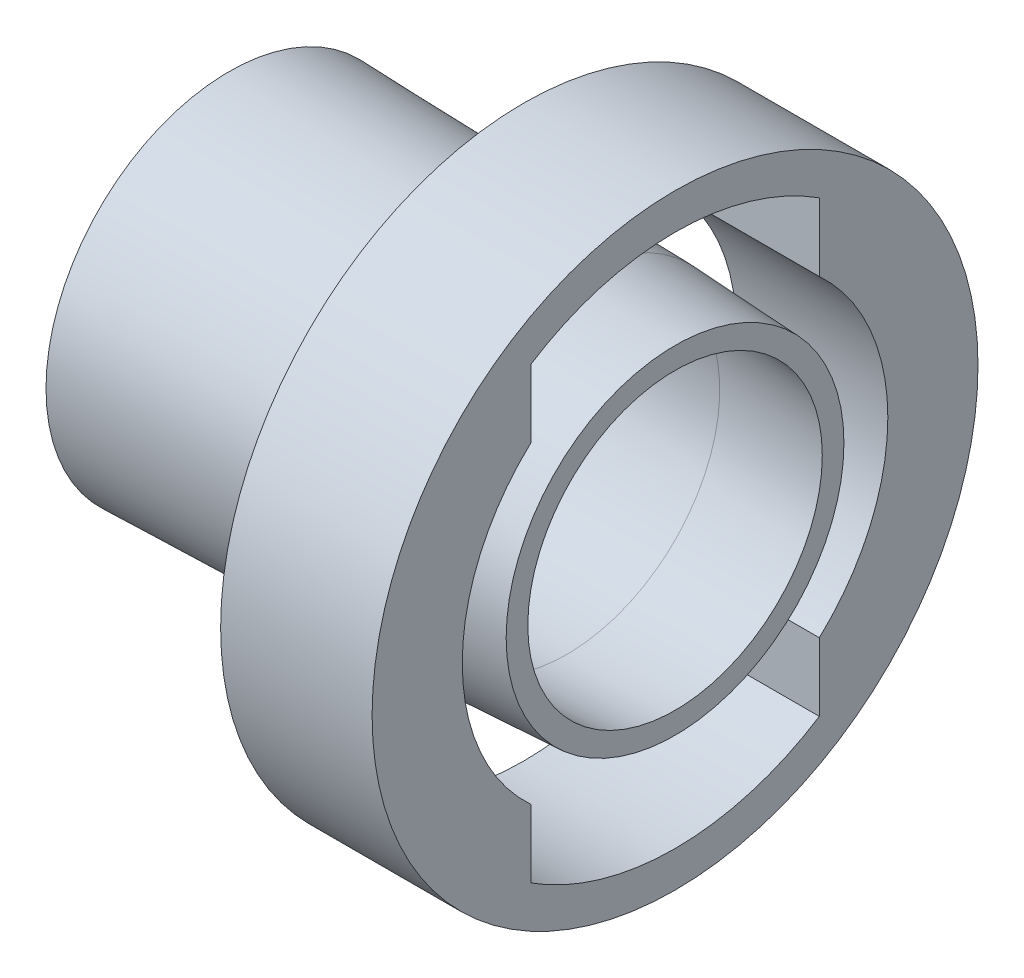
ISO-10303-21;
HEADER;
FILE_DESCRIPTION(('STEP AP214'),'2;1');
FILE_NAME('part.step','',(''),(''),'','','');
FILE_SCHEMA(('AUTOMOTIVE_DESIGN { 1 0 10303 214 1 1 1 1 }'));
ENDSEC;
DATA;
#1=APPLICATION_CONTEXT('core data for automotive mechanical design processes');
#2=APPLICATION_PROTOCOL_DEFINITION('international standard','automotive_design',2000,#1);
#3=PRODUCT_CONTEXT('',#1,'mechanical');
#4=PRODUCT('Part','Part','',(#3));
#5=PRODUCT_RELATED_PRODUCT_CATEGORY('part','',(#4));
#6=PRODUCT_DEFINITION_FORMATION('','',#4);
#7=PRODUCT_DEFINITION_CONTEXT('part definition',#1,'design');
#8=PRODUCT_DEFINITION('design','',#6,#7);
#9=PRODUCT_DEFINITION_SHAPE('','',#8);
#10=(LENGTH_UNIT() NAMED_UNIT(*) SI_UNIT(.MILLI.,.METRE.));
#11=(NAMED_UNIT(*) PLANE_ANGLE_UNIT() SI_UNIT($,.RADIAN.));
#12=(NAMED_UNIT(*) SI_UNIT($,.STERADIAN.) SOLID_ANGLE_UNIT());
#13=UNCERTAINTY_MEASURE_WITH_UNIT(LENGTH_MEASURE(1.E-05),#10,'distance_accuracy_value','');
#14=(GEOMETRIC_REPRESENTATION_CONTEXT(3) GLOBAL_UNCERTAINTY_ASSIGNED_CONTEXT((#13)) GLOBAL_UNIT_ASSIGNED_CONTEXT((#10,
#11,#12)) REPRESENTATION_CONTEXT('',''));
#15=CARTESIAN_POINT('',(0.,0.,0.));
#16=DIRECTION('',(0.,0.,1.));
#17=DIRECTION('',(1.,0.,0.));
#18=AXIS2_PLACEMENT_3D('',#15,#16,#17);
#19=CARTESIAN_POINT('',(-30.9187470712354,11.185,0.));
#20=DIRECTION('',(1.,0.,0.));
#21=DIRECTION('',(0.,0.,-1.));
#22=AXIS2_PLACEMENT_3D('',#19,#20,#21);
#23=PLANE('',#22);
#24=CARTESIAN_POINT('',(-30.9187470712354,0.,0.));
#25=DIRECTION('',(-1.,0.,0.));
#26=DIRECTION('',(0.,0.,1.));
#27=AXIS2_PLACEMENT_3D('',#24,#25,#26);
#28=CIRCLE('',#27,11.185);
#29=CARTESIAN_POINT('',(-30.9187470712354,0.,11.185));
#30=VERTEX_POINT('',#29);
#31=EDGE_CURVE('E151',#30,#30,#28,.T.);
#32=ORIENTED_EDGE('',*,*,#31,.F.);
#33=EDGE_LOOP('',(#32));
#34=FACE_BOUND('',#33,.T.);
#35=CARTESIAN_POINT('',(-30.9187470712354,0.,0.));
#36=DIRECTION('',(-1.,0.,0.));
#37=DIRECTION('',(0.,0.,1.));
#38=AXIS2_PLACEMENT_3D('',#35,#36,#37);
#39=CIRCLE('',#38,12.6854686767807);
#40=CARTESIAN_POINT('',(-30.9187470712354,0.,12.6854686767807));
#41=VERTEX_POINT('',#40);
#42=EDGE_CURVE('E13',#41,#41,#39,.T.);
#43=ORIENTED_EDGE('',*,*,#42,.T.);
#44=EDGE_LOOP('',(#43));
#45=FACE_BOUND('',#44,.T.);
#46=ADVANCED_FACE('F129',(#34,#45),#23,.F.);
#47=CARTESIAN_POINT('',(-7.5,0.,0.));
#48=DIRECTION('',(-1.,0.,0.));
#49=DIRECTION('',(0.,0.,1.));
#50=AXIS2_PLACEMENT_3D('',#47,#48,#49);
#51=CONICAL_SURFACE('',#50,12.1,0.024994793618913);
#52=ORIENTED_EDGE('',*,*,#42,.F.);
#53=EDGE_LOOP('',(#52));
#54=FACE_BOUND('',#53,.T.);
#55=CARTESIAN_POINT('',(-7.5,0.,0.));
#56=DIRECTION('',(-1.,0.,0.));
#57=DIRECTION('',(0.,0.,1.));
#58=AXIS2_PLACEMENT_3D('',#55,#56,#57);
#59=CIRCLE('',#58,12.1);
#60=CARTESIAN_POINT('',(-7.5,0.,12.1));
#61=VERTEX_POINT('',#60);
#62=EDGE_CURVE('E135',#61,#61,#59,.T.);
#63=ORIENTED_EDGE('',*,*,#62,.T.);
#64=EDGE_LOOP('',(#63));
#65=FACE_BOUND('',#64,.T.);
#66=ADVANCED_FACE('F158',(#54,#65),#51,.T.);
#67=CARTESIAN_POINT('',(0.,0.,0.));
#68=DIRECTION('',(-1.,0.,0.));
#69=DIRECTION('',(0.,0.,1.));
#70=AXIS2_PLACEMENT_3D('',#67,#68,#69);
#71=CONICAL_SURFACE('',#70,11.7069416553772,0.0523598775598228);
#72=ORIENTED_EDGE('',*,*,#62,.F.);
#73=EDGE_LOOP('',(#72));
#74=FACE_BOUND('',#73,.T.);
#75=CARTESIAN_POINT('',(0.,0.,0.));
#76=DIRECTION('',(-1.,0.,0.));
#77=DIRECTION('',(0.,0.,1.));
#78=AXIS2_PLACEMENT_3D('',#75,#76,#77);
#79=CIRCLE('',#78,11.7069416553772);
#80=CARTESIAN_POINT('',(0.,0.,11.7069416553772));
#81=VERTEX_POINT('',#80);
#82=EDGE_CURVE('E139',#81,#81,#79,.T.);
#83=ORIENTED_EDGE('',*,*,#82,.T.);
#84=EDGE_LOOP('',(#83));
#85=FACE_BOUND('',#84,.T.);
#86=ADVANCED_FACE('F162',(#74,#85),#71,.T.);
#87=CARTESIAN_POINT('',(0.,10.2064729785965,0.));
#88=DIRECTION('',(-1.,0.,0.));
#89=DIRECTION('',(0.,0.,1.));
#90=AXIS2_PLACEMENT_3D('',#87,#88,#89);
#91=PLANE('',#90);
#92=ORIENTED_EDGE('',*,*,#82,.F.);
#93=EDGE_LOOP('',(#92));
#94=FACE_BOUND('',#93,.T.);
#95=CARTESIAN_POINT('',(0.,0.,0.));
#96=DIRECTION('',(-1.,0.,0.));
#97=DIRECTION('',(0.,0.,1.));
#98=AXIS2_PLACEMENT_3D('',#95,#96,#97);
#99=CIRCLE('',#98,10.2064729785965);
#100=CARTESIAN_POINT('',(0.,0.,10.2064729785965));
#101=VERTEX_POINT('',#100);
#102=EDGE_CURVE('E143',#101,#101,#99,.T.);
#103=ORIENTED_EDGE('',*,*,#102,.T.);
#104=EDGE_LOOP('',(#103));
#105=FACE_BOUND('',#104,.T.);
#106=ADVANCED_FACE('F167',(#94,#105),#91,.F.);
#107=CARTESIAN_POINT('',(-7.5,0.,0.));
#108=DIRECTION('',(-1.,0.,0.));
#109=DIRECTION('',(0.,0.,1.));
#110=AXIS2_PLACEMENT_3D('',#107,#108,#109);
#111=CONICAL_SURFACE('',#110,10.5995313232193,0.0523598775598223);
#112=ORIENTED_EDGE('',*,*,#102,.F.);
#113=EDGE_LOOP('',(#112));
#114=FACE_BOUND('',#113,.T.);
#115=CARTESIAN_POINT('',(-7.5,0.,0.));
#116=DIRECTION('',(-1.,0.,0.));
#117=DIRECTION('',(0.,0.,1.));
#118=AXIS2_PLACEMENT_3D('',#115,#116,#117);
#119=CIRCLE('',#118,10.5995313232193);
#120=CARTESIAN_POINT('',(-7.5,0.,10.5995313232193));
#121=VERTEX_POINT('',#120);
#122=EDGE_CURVE('E148',#121,#121,#119,.T.);
#123=ORIENTED_EDGE('',*,*,#122,.T.);
#124=EDGE_LOOP('',(#123));
#125=FACE_BOUND('',#124,.T.);
#126=ADVANCED_FACE('F173',(#114,#125),#111,.F.);
#127=CARTESIAN_POINT('',(-30.9187470712354,0.,0.));
#128=DIRECTION('',(-1.,0.,0.));
#129=DIRECTION('',(0.,0.,1.));
#130=AXIS2_PLACEMENT_3D('',#127,#128,#129);
#131=CONICAL_SURFACE('',#130,11.185,0.0249947936189131);
#132=ORIENTED_EDGE('',*,*,#122,.F.);
#133=EDGE_LOOP('',(#132));
#134=FACE_BOUND('',#133,.T.);
#135=ORIENTED_EDGE('',*,*,#31,.T.);
#136=EDGE_LOOP('',(#135));
#137=FACE_BOUND('',#136,.T.);
#138=ADVANCED_FACE('F155',(#134,#137),#131,.F.);
#139=CLOSED_SHELL('',(#46,#66,#86,#106,#126,#138));
#140=MANIFOLD_SOLID_BREP('B2',#139);
#141=CARTESIAN_POINT('',(0.,0.,0.));
#142=DIRECTION('',(-1.,0.,0.));
#143=DIRECTION('',(0.,0.,1.));
#144=AXIS2_PLACEMENT_3D('',#141,#142,#143);
#145=CYLINDRICAL_SURFACE('',#144,14.75);
#146=DIRECTION('',(-1.,0.,0.));
#147=VECTOR('',#146,1.);
#148=CARTESIAN_POINT('',(0.,-10.,10.8426242211007));
#149=LINE('',#148,#147);
#150=CARTESIAN_POINT('',(-3.5,-10.,10.8426242211007));
#151=VERTEX_POINT('',#150);
#152=CARTESIAN_POINT('',(-10.5,-10.,10.8426242211007));
#153=VERTEX_POINT('',#152);
#154=EDGE_CURVE('E414',#151,#153,#149,.T.);
#155=ORIENTED_EDGE('',*,*,#154,.F.);
#156=CARTESIAN_POINT('',(-3.5,-10.,10.8426242211007));
#157=CARTESIAN_POINT('',(-3.49068289825081,-9.8477461184323,10.9830490255692));
#158=CARTESIAN_POINT('',(-3.48131075614257,-9.6925330119664,11.1202618603278));
#159=CARTESIAN_POINT('',(-3.46279008685107,-9.37644426882183,11.3880500590856));
#160=CARTESIAN_POINT('',(-3.45364158134082,-9.21556808698197,11.5186247810872));
#161=CARTESIAN_POINT('',(-3.43590345498772,-8.88843208529065,11.7729010977128));
#162=CARTESIAN_POINT('',(-3.42731385645937,-8.72217205088384,11.8966024178857));
#163=CARTESIAN_POINT('',(-3.41104249384766,-8.38455850021666,12.136911055014));
#164=CARTESIAN_POINT('',(-3.40336072831973,-8.21320499206174,12.2535183832575));
#165=CARTESIAN_POINT('',(-3.38928491143141,-7.8663626586734,12.4790007927033));
#166=CARTESIAN_POINT('',(-3.38288605798964,-7.69089210914528,12.5879036822798));
#167=CARTESIAN_POINT('',(-3.37169056811283,-7.33550167693567,12.7982636098841));
#168=CARTESIAN_POINT('',(-3.36689386758477,-7.15558197254891,12.8997209456393));
#169=CARTESIAN_POINT('',(-3.35925139711313,-6.79160724586054,13.0950076143184));
#170=CARTESIAN_POINT('',(-3.35640563031815,-6.60755221688548,13.1888369349313));
#171=CARTESIAN_POINT('',(-3.35300998458459,-6.23562805862445,13.3686991030945));
#172=CARTESIAN_POINT('',(-3.35246031828272,-6.04775857770946,13.4547312278423));
#173=CARTESIAN_POINT('',(-3.35399271306223,-5.66957066777972,13.6183956052958));
#174=CARTESIAN_POINT('',(-3.35606103103027,-5.4792701758139,13.6960694195787));
#175=CARTESIAN_POINT('',(-3.36313375256999,-5.09563254197148,13.8433828718047));
#176=CARTESIAN_POINT('',(-3.36813821251843,-4.90229534185652,13.9130223554502));
#177=CARTESIAN_POINT('',(-3.38140066455927,-4.51300606778088,14.0441251987416));
#178=CARTESIAN_POINT('',(-3.38965820562703,-4.31705435994666,14.1055896902329));
#179=CARTESIAN_POINT('',(-3.40974253713639,-3.92297120097847,14.2202285460817));
#180=CARTESIAN_POINT('',(-3.42156850615943,-3.72484026158584,14.2734048140428));
#181=CARTESIAN_POINT('',(-3.44909157620783,-3.3264617160412,14.371475016524));
#182=CARTESIAN_POINT('',(-3.46479476862795,-3.12621125840935,14.416355722226));
#183=CARTESIAN_POINT('',(-3.4914239931403,-2.82483212453093,14.4773386711365));
#184=CARTESIAN_POINT('',(-3.50081360223244,-2.72419781451132,14.4966111405956));
#185=CARTESIAN_POINT('',(-3.52056913752248,-2.52264225536133,14.5330404122778));
#186=CARTESIAN_POINT('',(-3.53093506737886,-2.42172100515709,14.5501972065725));
#187=CARTESIAN_POINT('',(-3.56317847114939,-2.11853430051751,14.5985001477906));
#188=CARTESIAN_POINT('',(-3.58619875961502,-1.91587640617345,14.6264726823367));
#189=CARTESIAN_POINT('',(-3.63402577487051,-1.50977032851817,14.6739529877871));
#190=CARTESIAN_POINT('',(-3.65883269078366,-1.30632206370521,14.6934598610195));
#191=CARTESIAN_POINT('',(-3.70790370990943,-0.908007467752809,14.7233181561805));
#192=CARTESIAN_POINT('',(-3.73214220621249,-0.713165778755622,14.7340411920772));
#193=CARTESIAN_POINT('',(-3.7801133763745,-0.323186388277613,14.7477493605214));
#194=CARTESIAN_POINT('',(-3.80384614929502,-0.128048752939792,14.7507360225554));
#195=CARTESIAN_POINT('',(-3.84974660401898,0.26233807443667,14.7489583212846));
#196=CARTESIAN_POINT('',(-3.87191460438859,0.457587235563059,14.744195540436));
#197=CARTESIAN_POINT('',(-3.91354830173493,0.848021805362069,14.7268985185325));
#198=CARTESIAN_POINT('',(-3.9330141758796,1.04320721737651,14.7143647872835));
#199=CARTESIAN_POINT('',(-3.96794187873431,1.43267855249339,14.6815531272648));
#200=CARTESIAN_POINT('',(-3.98341599948806,1.62696538289636,14.6612994600578));
#201=CARTESIAN_POINT('',(-4.00908821693341,2.01495051242341,14.6130314223098));
#202=CARTESIAN_POINT('',(-4.01928572095076,2.20864874300743,14.5850161805243));
#203=CARTESIAN_POINT('',(-4.03453432644098,2.59497859036452,14.5212574463459));
#204=CARTESIAN_POINT('',(-4.03958521958272,2.78761016364619,14.4855136411774));
#205=CARTESIAN_POINT('',(-4.04484618312528,3.1713414566988,14.4063692255715));
#206=CARTESIAN_POINT('',(-4.04505654734346,3.36244126874287,14.3629690800308));
#207=CARTESIAN_POINT('',(-4.04030693120079,3.80014403968906,14.2543484854418));
#208=CARTESIAN_POINT('',(-4.03376651310837,4.04608205763247,14.1864964121077));
#209=CARTESIAN_POINT('',(-4.01367589955739,4.53385126820216,14.0382222601152));
#210=CARTESIAN_POINT('',(-4.00012520148263,4.77568216507588,13.9577992804489));
#211=CARTESIAN_POINT('',(-3.96673208834328,5.25447696901661,13.7846935373355));
#212=CARTESIAN_POINT('',(-3.94688946102543,5.49144071160682,13.6920103603618));
#213=CARTESIAN_POINT('',(-3.90155390071219,5.96080348827687,13.4943116413055));
#214=CARTESIAN_POINT('',(-3.87603729022978,6.19317881566554,13.3892453142282));
#215=CARTESIAN_POINT('',(-3.82016489629219,6.65168404722985,13.16747696156));
#216=CARTESIAN_POINT('',(-3.78980945900371,6.87781439681069,13.0507757685438));
#217=CARTESIAN_POINT('',(-3.72502918064806,7.32327547825964,12.8061197597428));
#218=CARTESIAN_POINT('',(-3.69060468270425,7.54260678149104,12.6781658930719));
#219=CARTESIAN_POINT('',(-3.62262200384524,7.94908703490707,12.4267793947215));
#220=CARTESIAN_POINT('',(-3.58942225734082,8.13702903450714,12.3045288916445));
#221=CARTESIAN_POINT('',(-3.52097836679001,8.50688398153636,12.0517877328957));
#222=CARTESIAN_POINT('',(-3.48573437310055,8.68879737083472,11.9212976831905));
#223=CARTESIAN_POINT('',(-3.41372941216736,9.04630858841445,11.6523320036907));
#224=CARTESIAN_POINT('',(-3.37696844277384,9.221906407745,11.5138563625792));
#225=CARTESIAN_POINT('',(-3.30270700292207,9.56530827383105,11.2301663004948));
#226=CARTESIAN_POINT('',(-3.26521342442737,9.7331579059977,11.0850052418789));
#227=CARTESIAN_POINT('',(-3.18973828898552,10.0620776773763,10.78732083924));
#228=CARTESIAN_POINT('',(-3.15175673808728,10.2231479005201,10.6347975864143));
#229=CARTESIAN_POINT('',(-3.07577549236125,10.5382375216478,10.3226563465279));
#230=CARTESIAN_POINT('',(-3.03777579867568,10.6922573161895,10.1630387594923));
#231=CARTESIAN_POINT('',(-3.,10.8426242211014,10.0000000000002));
#232=B_SPLINE_CURVE_WITH_KNOTS('',3,(#156,#157,#158,#159,#160,#161,#162,#163,#164,#165,#166,
#167,#168,#169,#170,#171,#172,#173,#174,#175,#176,#177,#178,#179,#180,#181,#182,#183,#184,#185,
#186,#187,#188,#189,#190,#191,#192,#193,#194,#195,#196,#197,#198,#199,#200,#201,#202,#203,#204,
#205,#206,#207,#208,#209,#210,#211,#212,#213,#214,#215,#216,#217,#218,#219,#220,#221,#222,#223,
#224,#225,#226,#227,#228,#229,#230,#231),.UNSPECIFIED.,.F.,.F.,(4,2,2,2,2,2,2,2,2,2,2,2,2,2,2,2,
2,2,2,2,2,2,2,2,2,2,2,2,2,2,2,2,2,2,2,2,2,4),(0.,0.621954927275421,1.24396989224003,
1.86600967610192,2.48804847014078,3.10771355154563,3.72735384070553,4.34699512989301,
4.96669380139528,5.58315281424756,6.19962366409531,6.81600907317592,7.43225270422974,
8.0494707281461,8.35812465148851,8.66677973146638,9.28418357925544,9.9016528786028,
10.491409460435,11.0810494380803,11.6705690248248,12.2600499407785,12.8476933599291,
13.435402769387,14.0231359679552,14.6108334913566,15.3759943229841,16.1412100219707,
16.9064515376522,17.6749484143476,18.443390337901,19.2117675087893,19.8914771184436,
20.5711367978474,21.2507974404679,21.9257470666609,22.6006883342324,23.2755915923457),.UNSPECIFIED.);
#233=CARTESIAN_POINT('',(-3.,10.8426242211007,10.));
#234=VERTEX_POINT('',#233);
#235=EDGE_CURVE('E327',#151,#234,#232,.T.);
#236=ORIENTED_EDGE('',*,*,#235,.T.);
#237=DIRECTION('',(1.,0.,0.));
#238=VECTOR('',#237,1.);
#239=CARTESIAN_POINT('',(-10.5,10.8426242211007,10.));
#240=LINE('',#239,#238);
#241=CARTESIAN_POINT('',(0.,10.8426242211007,10.));
#242=VERTEX_POINT('',#241);
#243=EDGE_CURVE('E301',#234,#242,#240,.T.);
#244=ORIENTED_EDGE('',*,*,#243,.T.);
#245=CARTESIAN_POINT('',(0.,0.,0.));
#246=DIRECTION('',(-1.,0.,0.));
#247=DIRECTION('',(0.,0.,1.));
#248=AXIS2_PLACEMENT_3D('',#245,#246,#247);
#249=CIRCLE('',#248,14.75);
#250=CARTESIAN_POINT('',(0.,-10.8426242211007,10.));
#251=VERTEX_POINT('',#250);
#252=EDGE_CURVE('E293',#251,#242,#249,.T.);
#253=ORIENTED_EDGE('',*,*,#252,.F.);
#254=DIRECTION('',(1.,0.,0.));
#255=VECTOR('',#254,1.);
#256=CARTESIAN_POINT('',(-10.5,-10.8426242211007,10.));
#257=LINE('',#256,#255);
#258=CARTESIAN_POINT('',(-10.5,-10.8426242211007,10.));
#259=VERTEX_POINT('',#258);
#260=EDGE_CURVE('E248',#259,#251,#257,.T.);
#261=ORIENTED_EDGE('',*,*,#260,.F.);
#262=CARTESIAN_POINT('',(-10.5,0.,0.));
#263=DIRECTION('',(-1.,0.,0.));
#264=DIRECTION('',(0.,0.,1.));
#265=AXIS2_PLACEMENT_3D('',#262,#263,#264);
#266=CIRCLE('',#265,14.75);
#267=EDGE_CURVE('E292',#259,#153,#266,.T.);
#268=ORIENTED_EDGE('',*,*,#267,.T.);
#269=EDGE_LOOP('',(#155,#236,#244,#253,#261,#268));
#270=FACE_BOUND('',#269,.T.);
#271=ADVANCED_FACE('F221',(#270),#145,.F.);
#272=CARTESIAN_POINT('',(-10.5,0.,0.));
#273=DIRECTION('',(1.,0.,0.));
#274=DIRECTION('',(0.,0.,-1.));
#275=AXIS2_PLACEMENT_3D('',#272,#273,#274);
#276=PLANE('',#275);
#277=CARTESIAN_POINT('',(-10.5,0.,0.));
#278=DIRECTION('',(-1.,0.,0.));
#279=DIRECTION('',(0.,0.,1.));
#280=AXIS2_PLACEMENT_3D('',#277,#278,#279);
#281=CIRCLE('',#280,21.);
#282=CARTESIAN_POINT('',(-10.5,0.,21.));
#283=VERTEX_POINT('',#282);
#284=EDGE_CURVE('E320',#283,#283,#281,.T.);
#285=ORIENTED_EDGE('',*,*,#284,.T.);
#286=EDGE_LOOP('',(#285));
#287=FACE_BOUND('',#286,.T.);
#288=DIRECTION('',(0.,0.,-1.));
#289=VECTOR('',#288,1.);
#290=CARTESIAN_POINT('',(-10.5,-10.,9.84262422110071));
#291=LINE('',#290,#289);
#292=CARTESIAN_POINT('',(-10.5,-10.,15.5643824162734));
#293=VERTEX_POINT('',#292);
#294=EDGE_CURVE('E437',#293,#153,#291,.T.);
#295=ORIENTED_EDGE('',*,*,#294,.T.);
#296=ORIENTED_EDGE('',*,*,#267,.F.);
#297=DIRECTION('',(0.,1.,0.));
#298=VECTOR('',#297,1.);
#299=CARTESIAN_POINT('',(-10.5,0.,10.));
#300=LINE('',#299,#298);
#301=CARTESIAN_POINT('',(-10.5,-15.5643824162734,10.));
#302=VERTEX_POINT('',#301);
#303=EDGE_CURVE('E462',#302,#259,#300,.T.);
#304=ORIENTED_EDGE('',*,*,#303,.F.);
#305=CARTESIAN_POINT('',(-10.5,0.,0.));
#306=DIRECTION('',(1.,0.,0.));
#307=DIRECTION('',(0.,0.,-1.));
#308=AXIS2_PLACEMENT_3D('',#305,#306,#307);
#309=CIRCLE('',#308,18.5);
#310=CARTESIAN_POINT('',(-10.5,-15.5643824162734,-10.));
#311=VERTEX_POINT('',#310);
#312=EDGE_CURVE('E460',#311,#302,#309,.F.);
#313=ORIENTED_EDGE('',*,*,#312,.F.);
#314=DIRECTION('',(0.,1.,0.));
#315=VECTOR('',#314,1.);
#316=CARTESIAN_POINT('',(-10.5,0.,-10.));
#317=LINE('',#316,#315);
#318=CARTESIAN_POINT('',(-10.5,-10.8426242211007,-10.));
#319=VERTEX_POINT('',#318);
#320=EDGE_CURVE('E457',#311,#319,#317,.T.);
#321=ORIENTED_EDGE('',*,*,#320,.T.);
#322=CARTESIAN_POINT('',(-10.5,10.8426242211007,-10.));
#323=VERTEX_POINT('',#322);
#324=EDGE_CURVE('E283',#323,#319,#266,.T.);
#325=ORIENTED_EDGE('',*,*,#324,.F.);
#326=DIRECTION('',(0.,-1.,0.));
#327=VECTOR('',#326,1.);
#328=CARTESIAN_POINT('',(-10.5,0.,-10.));
#329=LINE('',#328,#327);
#330=CARTESIAN_POINT('',(-10.5,15.5643824162734,-10.));
#331=VERTEX_POINT('',#330);
#332=EDGE_CURVE('E464',#331,#323,#329,.T.);
#333=ORIENTED_EDGE('',*,*,#332,.F.);
#334=CARTESIAN_POINT('',(-10.5,0.,0.));
#335=DIRECTION('',(1.,0.,0.));
#336=DIRECTION('',(0.,0.,-1.));
#337=AXIS2_PLACEMENT_3D('',#334,#335,#336);
#338=CIRCLE('',#337,18.5);
#339=CARTESIAN_POINT('',(-10.5,15.5643824162734,10.));
#340=VERTEX_POINT('',#339);
#341=EDGE_CURVE('E329',#340,#331,#338,.F.);
#342=ORIENTED_EDGE('',*,*,#341,.F.);
#343=CARTESIAN_POINT('',(-10.5,15.5643824162734,10.));
#344=CARTESIAN_POINT('',(-10.5,13.5107102991569,13.1964138188438));
#345=CARTESIAN_POINT('',(-10.5,10.0959682442306,15.9941540069139));
#346=CARTESIAN_POINT('',(-10.5,5.63706378043799,17.6498691461082));
#347=CARTESIAN_POINT('',(-10.5,3.30744822542792,18.2612567423603));
#348=CARTESIAN_POINT('',(-10.5,1.32645603147929,18.4928644130839));
#349=CARTESIAN_POINT('',(-10.5,-0.476464522258134,18.5013670453642));
#350=CARTESIAN_POINT('',(-10.5,-4.03963049920302,18.3392281470737));
#351=CARTESIAN_POINT('',(-10.5,-7.36265944829708,17.2588541152889));
#352=CARTESIAN_POINT('',(-10.5,-10.,15.5643824162734));
#353=B_SPLINE_CURVE_WITH_KNOTS('',3,(#343,#344,#345,#346,#347,#348,#349,#350,#351,#352),
.UNSPECIFIED.,.F.,.F.,(4,1,1,1,1,1,1,4),(0.,0.375,0.444620298396432,0.5,0.625,0.643572908926656,
0.6875,1.),.UNSPECIFIED.);
#354=EDGE_CURVE('E442',#340,#293,#353,.T.);
#355=ORIENTED_EDGE('',*,*,#354,.T.);
#356=EDGE_LOOP('',(#295,#296,#304,#313,#321,#325,#333,#342,#355));
#357=FACE_BOUND('',#356,.T.);
#358=ADVANCED_FACE('F420',(#287,#357),#276,.F.);
#359=CARTESIAN_POINT('',(0.,0.,0.));
#360=DIRECTION('',(-1.,0.,0.));
#361=DIRECTION('',(0.,0.,1.));
#362=AXIS2_PLACEMENT_3D('',#359,#360,#361);
#363=CYLINDRICAL_SURFACE('',#362,21.);
#364=CARTESIAN_POINT('',(0.,0.,0.));
#365=DIRECTION('',(-1.,0.,0.));
#366=DIRECTION('',(0.,0.,1.));
#367=AXIS2_PLACEMENT_3D('',#364,#365,#366);
#368=CIRCLE('',#367,21.);
#369=CARTESIAN_POINT('',(0.,0.,21.));
#370=VERTEX_POINT('',#369);
#371=EDGE_CURVE('E284',#370,#370,#368,.T.);
#372=ORIENTED_EDGE('',*,*,#371,.T.);
#373=EDGE_LOOP('',(#372));
#374=FACE_BOUND('',#373,.T.);
#375=ORIENTED_EDGE('',*,*,#284,.F.);
#376=EDGE_LOOP('',(#375));
#377=FACE_BOUND('',#376,.T.);
#378=ADVANCED_FACE('F223',(#374,#377),#363,.T.);
#379=ORIENTED_EDGE('',*,*,#324,.T.);
#380=DIRECTION('',(1.,0.,0.));
#381=VECTOR('',#380,1.);
#382=CARTESIAN_POINT('',(-10.5,-10.8426242211007,-10.));
#383=LINE('',#382,#381);
#384=CARTESIAN_POINT('',(0.,-10.8426242211007,-10.));
#385=VERTEX_POINT('',#384);
#386=EDGE_CURVE('E269',#319,#385,#383,.T.);
#387=ORIENTED_EDGE('',*,*,#386,.T.);
#388=CARTESIAN_POINT('',(0.,0.,0.));
#389=DIRECTION('',(-1.,0.,0.));
#390=DIRECTION('',(0.,0.,1.));
#391=AXIS2_PLACEMENT_3D('',#388,#389,#390);
#392=CIRCLE('',#391,14.75);
#393=CARTESIAN_POINT('',(0.,10.8426242211007,-10.));
#394=VERTEX_POINT('',#393);
#395=EDGE_CURVE('E281',#394,#385,#392,.T.);
#396=ORIENTED_EDGE('',*,*,#395,.F.);
#397=DIRECTION('',(1.,0.,0.));
#398=VECTOR('',#397,1.);
#399=CARTESIAN_POINT('',(-10.5,10.8426242211007,-10.));
#400=LINE('',#399,#398);
#401=EDGE_CURVE('E315',#323,#394,#400,.T.);
#402=ORIENTED_EDGE('',*,*,#401,.F.);
#403=EDGE_LOOP('',(#379,#387,#396,#402));
#404=FACE_BOUND('',#403,.T.);
#405=ADVANCED_FACE('F279',(#404),#145,.F.);
#406=CARTESIAN_POINT('',(0.,0.,0.));
#407=DIRECTION('',(1.,0.,0.));
#408=DIRECTION('',(0.,0.,-1.));
#409=AXIS2_PLACEMENT_3D('',#406,#407,#408);
#410=PLANE('',#409);
#411=DIRECTION('',(0.,1.,0.));
#412=VECTOR('',#411,1.);
#413=CARTESIAN_POINT('',(0.,0.,-10.));
#414=LINE('',#413,#412);
#415=CARTESIAN_POINT('',(0.,-15.5643824162734,-10.));
#416=VERTEX_POINT('',#415);
#417=EDGE_CURVE('E127',#416,#385,#414,.T.);
#418=ORIENTED_EDGE('',*,*,#417,.F.);
#419=CARTESIAN_POINT('',(0.,0.,0.));
#420=DIRECTION('',(1.,0.,0.));
#421=DIRECTION('',(0.,0.,-1.));
#422=AXIS2_PLACEMENT_3D('',#419,#420,#421);
#423=CIRCLE('',#422,18.5);
#424=CARTESIAN_POINT('',(0.,-15.5643824162734,10.));
#425=VERTEX_POINT('',#424);
#426=EDGE_CURVE('E230',#416,#425,#423,.F.);
#427=ORIENTED_EDGE('',*,*,#426,.T.);
#428=DIRECTION('',(0.,1.,0.));
#429=VECTOR('',#428,1.);
#430=CARTESIAN_POINT('',(0.,0.,10.));
#431=LINE('',#430,#429);
#432=EDGE_CURVE('E486',#425,#251,#431,.T.);
#433=ORIENTED_EDGE('',*,*,#432,.T.);
#434=ORIENTED_EDGE('',*,*,#252,.T.);
#435=DIRECTION('',(0.,-1.,0.));
#436=VECTOR('',#435,1.);
#437=CARTESIAN_POINT('',(0.,0.,10.));
#438=LINE('',#437,#436);
#439=CARTESIAN_POINT('',(0.,15.5643824162734,10.));
#440=VERTEX_POINT('',#439);
#441=EDGE_CURVE('E483',#440,#242,#438,.T.);
#442=ORIENTED_EDGE('',*,*,#441,.F.);
#443=CARTESIAN_POINT('',(0.,0.,0.));
#444=DIRECTION('',(1.,0.,0.));
#445=DIRECTION('',(0.,0.,-1.));
#446=AXIS2_PLACEMENT_3D('',#443,#444,#445);
#447=CIRCLE('',#446,18.5);
#448=CARTESIAN_POINT('',(0.,15.5643824162734,-10.));
#449=VERTEX_POINT('',#448);
#450=EDGE_CURVE('E487',#440,#449,#447,.F.);
#451=ORIENTED_EDGE('',*,*,#450,.T.);
#452=DIRECTION('',(0.,1.,0.));
#453=VECTOR('',#452,1.);
#454=CARTESIAN_POINT('',(0.,0.,-10.));
#455=LINE('',#454,#453);
#456=EDGE_CURVE('E291',#449,#394,#455,.F.);
#457=ORIENTED_EDGE('',*,*,#456,.T.);
#458=ORIENTED_EDGE('',*,*,#395,.T.);
#459=EDGE_LOOP('',(#418,#427,#433,#434,#442,#451,#457,#458));
#460=FACE_BOUND('',#459,.T.);
#461=ORIENTED_EDGE('',*,*,#371,.F.);
#462=EDGE_LOOP('',(#461));
#463=FACE_BOUND('',#462,.T.);
#464=ADVANCED_FACE('F287',(#460,#463),#410,.T.);
#465=CARTESIAN_POINT('',(-10.5,0.,-10.));
#466=DIRECTION('',(0.,0.,1.));
#467=DIRECTION('',(0.,-1.,0.));
#468=AXIS2_PLACEMENT_3D('',#465,#466,#467);
#469=PLANE('',#468);
#470=DIRECTION('',(1.,0.,0.));
#471=VECTOR('',#470,1.);
#472=CARTESIAN_POINT('',(-10.5,15.5643824162734,-10.));
#473=LINE('',#472,#471);
#474=EDGE_CURVE('E312',#331,#449,#473,.T.);
#475=ORIENTED_EDGE('',*,*,#474,.F.);
#476=ORIENTED_EDGE('',*,*,#332,.T.);
#477=ORIENTED_EDGE('',*,*,#401,.T.);
#478=ORIENTED_EDGE('',*,*,#456,.F.);
#479=EDGE_LOOP('',(#475,#476,#477,#478));
#480=FACE_BOUND('',#479,.T.);
#481=ADVANCED_FACE('F521',(#480),#469,.T.);
#482=CARTESIAN_POINT('',(-10.5,0.,0.));
#483=DIRECTION('',(1.,0.,0.));
#484=DIRECTION('',(0.,0.,-1.));
#485=AXIS2_PLACEMENT_3D('',#482,#483,#484);
#486=CYLINDRICAL_SURFACE('',#485,18.5);
#487=CARTESIAN_POINT('',(-10.5,15.5643824162734,10.));
#488=CARTESIAN_POINT('',(-9.875,15.5643824162734,10.));
#489=CARTESIAN_POINT('',(-8.62500000000001,15.5643824162734,10.));
#490=CARTESIAN_POINT('',(-6.74999999999999,15.5643824162734,10.));
#491=CARTESIAN_POINT('',(-4.87500000000001,15.5643824162734,10.));
#492=CARTESIAN_POINT('',(-3.625,15.5643824162734,10.));
#493=CARTESIAN_POINT('',(-3.,15.5643824162734,10.));
#494=B_SPLINE_CURVE_WITH_KNOTS('',3,(#487,#488,#489,#490,#491,#492,#493),.UNSPECIFIED.,.F.,.F.,
(4,1,1,1,4),(0.72505475109584,0.79379106332188,0.86252737554792,0.93126368777396,1.),.UNSPECIFIED.);
#495=CARTESIAN_POINT('',(-3.,15.5643824162734,10.));
#496=VERTEX_POINT('',#495);
#497=EDGE_CURVE('E238',#340,#496,#494,.T.);
#498=ORIENTED_EDGE('',*,*,#497,.F.);
#499=ORIENTED_EDGE('',*,*,#341,.T.);
#500=ORIENTED_EDGE('',*,*,#474,.T.);
#501=ORIENTED_EDGE('',*,*,#450,.F.);
#502=DIRECTION('',(1.,0.,0.));
#503=VECTOR('',#502,1.);
#504=CARTESIAN_POINT('',(-10.5,15.5643824162734,10.));
#505=LINE('',#504,#503);
#506=EDGE_CURVE('E305',#496,#440,#505,.T.);
#507=ORIENTED_EDGE('',*,*,#506,.F.);
#508=EDGE_LOOP('',(#498,#499,#500,#501,#507));
#509=FACE_BOUND('',#508,.T.);
#510=ADVANCED_FACE('F494',(#509),#486,.F.);
#511=CARTESIAN_POINT('',(-10.5,0.,10.));
#512=DIRECTION('',(0.,0.,1.));
#513=DIRECTION('',(0.,-1.,0.));
#514=AXIS2_PLACEMENT_3D('',#511,#512,#513);
#515=PLANE('',#514);
#516=ORIENTED_EDGE('',*,*,#243,.F.);
#517=DIRECTION('',(0.,-1.,0.));
#518=VECTOR('',#517,1.);
#519=CARTESIAN_POINT('',(-3.,15.5643824162734,10.));
#520=LINE('',#519,#518);
#521=EDGE_CURVE('E480',#496,#234,#520,.T.);
#522=ORIENTED_EDGE('',*,*,#521,.F.);
#523=ORIENTED_EDGE('',*,*,#506,.T.);
#524=ORIENTED_EDGE('',*,*,#441,.T.);
#525=EDGE_LOOP('',(#516,#522,#523,#524));
#526=FACE_BOUND('',#525,.T.);
#527=ADVANCED_FACE('F478',(#526),#515,.F.);
#528=CARTESIAN_POINT('',(-10.5,0.,-10.));
#529=DIRECTION('',(0.,0.,-1.));
#530=DIRECTION('',(0.,1.,0.));
#531=AXIS2_PLACEMENT_3D('',#528,#529,#530);
#532=PLANE('',#531);
#533=ORIENTED_EDGE('',*,*,#417,.T.);
#534=ORIENTED_EDGE('',*,*,#386,.F.);
#535=ORIENTED_EDGE('',*,*,#320,.F.);
#536=DIRECTION('',(1.,0.,0.));
#537=VECTOR('',#536,1.);
#538=CARTESIAN_POINT('',(-10.5,-15.5643824162734,-10.));
#539=LINE('',#538,#537);
#540=EDGE_CURVE('E272',#311,#416,#539,.T.);
#541=ORIENTED_EDGE('',*,*,#540,.T.);
#542=EDGE_LOOP('',(#533,#534,#535,#541));
#543=FACE_BOUND('',#542,.T.);
#544=ADVANCED_FACE('F266',(#543),#532,.F.);
#545=CARTESIAN_POINT('',(-10.5,0.,0.));
#546=DIRECTION('',(1.,0.,0.));
#547=DIRECTION('',(0.,0.,-1.));
#548=AXIS2_PLACEMENT_3D('',#545,#546,#547);
#549=CYLINDRICAL_SURFACE('',#548,18.5);
#550=ORIENTED_EDGE('',*,*,#540,.F.);
#551=ORIENTED_EDGE('',*,*,#312,.T.);
#552=DIRECTION('',(1.,0.,0.));
#553=VECTOR('',#552,1.);
#554=CARTESIAN_POINT('',(-10.5,-15.5643824162734,10.));
#555=LINE('',#554,#553);
#556=EDGE_CURVE('E450',#302,#425,#555,.T.);
#557=ORIENTED_EDGE('',*,*,#556,.T.);
#558=ORIENTED_EDGE('',*,*,#426,.F.);
#559=EDGE_LOOP('',(#550,#551,#557,#558));
#560=FACE_BOUND('',#559,.T.);
#561=ADVANCED_FACE('F510',(#560),#549,.F.);
#562=CARTESIAN_POINT('',(-10.5,0.,10.));
#563=DIRECTION('',(0.,0.,-1.));
#564=DIRECTION('',(0.,1.,0.));
#565=AXIS2_PLACEMENT_3D('',#562,#563,#564);
#566=PLANE('',#565);
#567=ORIENTED_EDGE('',*,*,#556,.F.);
#568=ORIENTED_EDGE('',*,*,#303,.T.);
#569=ORIENTED_EDGE('',*,*,#260,.T.);
#570=ORIENTED_EDGE('',*,*,#432,.F.);
#571=EDGE_LOOP('',(#567,#568,#569,#570));
#572=FACE_BOUND('',#571,.T.);
#573=ADVANCED_FACE('F355',(#572),#566,.T.);
#574=CARTESIAN_POINT('',(0.,-10.,0.));
#575=DIRECTION('',(0.,1.,0.));
#576=DIRECTION('',(0.,0.,1.));
#577=AXIS2_PLACEMENT_3D('',#574,#575,#576);
#578=PLANE('',#577);
#579=ORIENTED_EDGE('',*,*,#154,.T.);
#580=ORIENTED_EDGE('',*,*,#294,.F.);
#581=DIRECTION('',(-1.,0.,0.));
#582=VECTOR('',#581,1.);
#583=CARTESIAN_POINT('',(-10.5,-10.,15.5643824162734));
#584=LINE('',#583,#582);
#585=CARTESIAN_POINT('',(-3.5,-10.,15.5643824162734));
#586=VERTEX_POINT('',#585);
#587=EDGE_CURVE('E328',#586,#293,#584,.T.);
#588=ORIENTED_EDGE('',*,*,#587,.F.);
#589=DIRECTION('',(0.,0.,1.));
#590=VECTOR('',#589,1.);
#591=CARTESIAN_POINT('',(-3.5,-10.,15.5643824162734));
#592=LINE('',#591,#590);
#593=EDGE_CURVE('E323',#151,#586,#592,.T.);
#594=ORIENTED_EDGE('',*,*,#593,.F.);
#595=EDGE_LOOP('',(#579,#580,#588,#594));
#596=FACE_BOUND('',#595,.T.);
#597=ADVANCED_FACE('F345',(#596),#578,.T.);
#598=CARTESIAN_POINT('',(-3.,9.84262422110072,10.));
#599=CARTESIAN_POINT('',(-3.51261352789351,7.93588588833496,12.0121261597216));
#600=CARTESIAN_POINT('',(-4.120395873851,4.87334358003497,13.5310641732689));
#601=CARTESIAN_POINT('',(-4.02296222796175,1.21804667014433,14.000444203741));
#602=CARTESIAN_POINT('',(-3.84409234672592,-0.624564721516219,14.0575467829029));
#603=CARTESIAN_POINT('',(-3.62393837009427,-2.10928075055225,13.9000622922116));
#604=CARTESIAN_POINT('',(-3.47942009675646,-3.44636618248088,13.6078467544294));
#605=CARTESIAN_POINT('',(-3.26089651231545,-6.07104506771383,12.9021172013586));
#606=CARTESIAN_POINT('',(-3.38829897772337,-8.34101954163337,11.5812973014079));
#607=CARTESIAN_POINT('',(-3.5,-10.,9.84262422110072));
#608=CARTESIAN_POINT('',(-3.,10.3194374040318,10.));
#609=CARTESIAN_POINT('',(-3.51261352789351,8.39700899725919,12.1074875310212));
#610=CARTESIAN_POINT('',(-4.120395873851,5.30918754756877,13.734789252636));
#611=CARTESIAN_POINT('',(-4.02296222796175,1.5863350665672,14.3045843733087));
#612=CARTESIAN_POINT('',(-3.84409234672592,-0.29722345811548,14.4084355467982));
#613=CARTESIAN_POINT('',(-3.62393837009427,-1.8223760446745,14.2832322693604));
#614=CARTESIAN_POINT('',(-3.47942009675646,-3.19899161028505,14.0155961889988));
#615=CARTESIAN_POINT('',(-3.26089651231545,-5.90411191028121,13.353775295478));
#616=CARTESIAN_POINT('',(-3.38829897772337,-8.26193306715854,12.0496887971622));
#617=CARTESIAN_POINT('',(-3.5,-10.,10.3194374040318));
#618=CARTESIAN_POINT('',(-3.,11.2730637698939,10.));
#619=CARTESIAN_POINT('',(-3.51261352789351,9.31925521510764,12.2982102736204));
#620=CARTESIAN_POINT('',(-4.12039587385101,6.18087548263637,14.1422394113701));
#621=CARTESIAN_POINT('',(-4.02296222796176,2.32291185941294,14.9128647124443));
#622=CARTESIAN_POINT('',(-3.84409234672592,0.357459068686,15.1102130745887));
#623=CARTESIAN_POINT('',(-3.62393837009427,-1.24856663291899,15.0495722236578));
#624=CARTESIAN_POINT('',(-3.47942009675646,-2.70424246589337,14.8310950581376));
#625=CARTESIAN_POINT('',(-3.26089651231545,-5.57024559541596,14.2570914837168));
#626=CARTESIAN_POINT('',(-3.38829897772337,-8.10376011820889,12.9864717886708));
#627=CARTESIAN_POINT('',(-3.5,-10.,11.2730637698939));
#628=CARTESIAN_POINT('',(-3.,12.703503318687,10.));
#629=CARTESIAN_POINT('',(-3.51261352789351,10.7026245418803,12.5842943875194));
#630=CARTESIAN_POINT('',(-4.120395873851,7.48840738523777,14.7534146494715));
#631=CARTESIAN_POINT('',(-4.02296222796175,3.42777704868155,15.8252852211476));
#632=CARTESIAN_POINT('',(-3.84409234672591,1.33948285888821,16.1628793662747));
#633=CARTESIAN_POINT('',(-3.62393837009427,-0.387852515285739,16.199082155104));
#634=CARTESIAN_POINT('',(-3.47942009675646,-1.96211874930586,16.0543433618458));
#635=CARTESIAN_POINT('',(-3.26089651231545,-5.06944612311809,15.612065766075));
#636=CARTESIAN_POINT('',(-3.38829897772337,-7.86650069478444,14.3916462759337));
#637=CARTESIAN_POINT('',(-3.5,-10.,12.703503318687));
#638=CARTESIAN_POINT('',(-3.,14.1339428674802,9.99999999999999));
#639=CARTESIAN_POINT('',(-3.51261352789351,12.085993868653,12.8703785014181));
#640=CARTESIAN_POINT('',(-4.12039587385101,8.79593928783917,15.3645898875726));
#641=CARTESIAN_POINT('',(-4.02296222796176,4.53264223795017,16.7377057298509));
#642=CARTESIAN_POINT('',(-3.84409234672592,2.32150664909043,17.2155456579606));
#643=CARTESIAN_POINT('',(-3.62393837009427,0.472861602347519,17.3485920865501));
#644=CARTESIAN_POINT('',(-3.47942009675647,-1.21999503271834,17.2775916655541));
#645=CARTESIAN_POINT('',(-3.26089651231545,-4.56864665082021,16.9670400484332));
#646=CARTESIAN_POINT('',(-3.38829897772337,-7.62924127135994,15.7968207631966));
#647=CARTESIAN_POINT('',(-3.5,-9.99999999999999,14.1339428674802));
#648=CARTESIAN_POINT('',(-3.,15.0875692333423,10.));
#649=CARTESIAN_POINT('',(-3.51261352789351,13.0082400865014,13.0611012440174));
#650=CARTESIAN_POINT('',(-4.12039587385101,9.66762722290677,15.7720400463068));
#651=CARTESIAN_POINT('',(-4.02296222796175,5.26921903079591,17.3459860689864));
#652=CARTESIAN_POINT('',(-3.84409234672591,2.97618917589191,17.9173231857512));
#653=CARTESIAN_POINT('',(-3.62393837009427,1.04667101410302,18.1149320408475));
#654=CARTESIAN_POINT('',(-3.47942009675647,-0.72524588832667,18.0930905346929));
#655=CARTESIAN_POINT('',(-3.26089651231545,-4.23478033595497,17.870356236672));
#656=CARTESIAN_POINT('',(-3.38829897772337,-7.4710683224103,16.7336037547052));
#657=CARTESIAN_POINT('',(-3.5,-10.,15.0875692333423));
#658=CARTESIAN_POINT('',(-3.,15.5643824162734,10.));
#659=CARTESIAN_POINT('',(-3.51261352789351,13.4693631954257,13.156462615317));
#660=CARTESIAN_POINT('',(-4.12039587385101,10.1034711904406,15.9757651256738));
#661=CARTESIAN_POINT('',(-4.02296222796175,5.63750742721878,17.6501262385542));
#662=CARTESIAN_POINT('',(-3.84409234672591,3.30353043929265,18.2682119496465));
#663=CARTESIAN_POINT('',(-3.62393837009427,1.33357571998077,18.4981020179963));
#664=CARTESIAN_POINT('',(-3.47942009675647,-0.477871316130833,18.5008399692623));
#665=CARTESIAN_POINT('',(-3.26089651231545,-4.06784717852234,18.3220143307914));
#666=CARTESIAN_POINT('',(-3.38829897772337,-7.39198184793548,17.2019952504595));
#667=CARTESIAN_POINT('',(-3.5,-10.,15.5643824162734));
#668=B_SPLINE_SURFACE_WITH_KNOTS('',3,3,((#598,#599,#600,#601,#602,#603,#604,#605,#606,#607),
(#608,#609,#610,#611,#612,#613,#614,#615,#616,#617),(#618,#619,#620,#621,#622,#623,#624,#625,
#626,#627),(#628,#629,#630,#631,#632,#633,#634,#635,#636,#637),(#638,#639,#640,#641,#642,#643,
#644,#645,#646,#647),(#648,#649,#650,#651,#652,#653,#654,#655,#656,#657),(#658,#659,#660,#661,
#662,#663,#664,#665,#666,#667)),.UNSPECIFIED.,.F.,.F.,.F.,(4,1,1,1,4),(4,1,1,1,1,1,1,4),(0.5,
0.55626368777396,0.61252737554792,0.66879106332188,0.72505475109584),(0.,0.375,
0.444620298396432,0.5,0.625,0.643572908926656,0.6875,1.),.UNSPECIFIED.);
#669=CARTESIAN_POINT('',(-3.,15.5643824162734,10.));
#670=CARTESIAN_POINT('',(-3.51261352789351,13.4693631954257,13.156462615317));
#671=CARTESIAN_POINT('',(-4.12039587385101,10.1034711904406,15.9757651256738));
#672=CARTESIAN_POINT('',(-4.02296222796175,5.63750742721878,17.6501262385542));
#673=CARTESIAN_POINT('',(-3.84409234672591,3.30353043929265,18.2682119496465));
#674=CARTESIAN_POINT('',(-3.62393837009427,1.33357571998077,18.4981020179963));
#675=CARTESIAN_POINT('',(-3.47942009675647,-0.477871316130833,18.5008399692623));
#676=CARTESIAN_POINT('',(-3.26089651231545,-4.06784717852234,18.3220143307914));
#677=CARTESIAN_POINT('',(-3.38829897772337,-7.39198184793548,17.2019952504595));
#678=CARTESIAN_POINT('',(-3.5,-10.,15.5643824162734));
#679=B_SPLINE_CURVE_WITH_KNOTS('',3,(#669,#670,#671,#672,#673,#674,#675,#676,#677,#678),
.UNSPECIFIED.,.F.,.F.,(4,1,1,1,1,1,1,4),(0.,0.375,0.444620298396432,0.5,0.625,0.643572908926656,
0.6875,1.),.UNSPECIFIED.);
#680=EDGE_CURVE('E506',#496,#586,#679,.T.);
#681=ORIENTED_EDGE('',*,*,#593,.T.);
#682=ORIENTED_EDGE('',*,*,#680,.F.);
#683=ORIENTED_EDGE('',*,*,#521,.T.);
#684=ORIENTED_EDGE('',*,*,#235,.F.);
#685=EDGE_LOOP('',(#681,#682,#683,#684));
#686=FACE_BOUND('',#685,.T.);
#687=ADVANCED_FACE('F354',(#686),#668,.F.);
#688=CARTESIAN_POINT('',(-3.,15.5643824162734,10.));
#689=CARTESIAN_POINT('',(-3.51261352789351,13.4693631954257,13.156462615317));
#690=CARTESIAN_POINT('',(-4.12039587385101,10.1034711904406,15.9757651256738));
#691=CARTESIAN_POINT('',(-4.02296222796175,5.63750742721878,17.6501262385542));
#692=CARTESIAN_POINT('',(-3.84409234672591,3.30353043929265,18.2682119496465));
#693=CARTESIAN_POINT('',(-3.62393837009427,1.33357571998077,18.4981020179963));
#694=CARTESIAN_POINT('',(-3.47942009675647,-0.477871316130833,18.5008399692623));
#695=CARTESIAN_POINT('',(-3.26089651231545,-4.06784717852234,18.3220143307914));
#696=CARTESIAN_POINT('',(-3.38829897772337,-7.39198184793548,17.2019952504595));
#697=CARTESIAN_POINT('',(-3.5,-10.,15.5643824162734));
#698=CARTESIAN_POINT('',(-3.625,15.5643824162734,10.));
#699=CARTESIAN_POINT('',(-4.09489573390238,13.4728087874033,13.1597918822776));
#700=CARTESIAN_POINT('',(-4.6520295510301,10.1028459449231,15.9772975324438));
#701=CARTESIAN_POINT('',(-4.5627153756316,5.63747045665372,17.6501048141837));
#702=CARTESIAN_POINT('',(-4.39875131783209,3.30385692147059,18.2676323490393));
#703=CARTESIAN_POINT('',(-4.19694350591975,1.33298241260565,18.4976655509202));
#704=CARTESIAN_POINT('',(-4.06446842202676,-0.477754083308107,18.5008838922707));
#705=CARTESIAN_POINT('',(-3.86415513628917,-4.06549578857907,18.3234488154816));
#706=CARTESIAN_POINT('',(-3.98094072957976,-7.38953831463228,17.2067334891952));
#707=CARTESIAN_POINT('',(-4.08333333333334,-10.,15.5643824162734));
#708=CARTESIAN_POINT('',(-4.87500000000001,15.5643824162734,10.));
#709=CARTESIAN_POINT('',(-5.25946014592014,13.4796999713585,13.1664504161987));
#710=CARTESIAN_POINT('',(-5.71529690538827,10.1015954538881,15.9803623459838));
#711=CARTESIAN_POINT('',(-5.64222167097131,5.63739651552358,17.6500619654427));
#712=CARTESIAN_POINT('',(-5.50806926004443,3.30450988582647,18.266473147825));
#713=CARTESIAN_POINT('',(-5.3429537775707,1.3317957978554,18.4967926167682));
#714=CARTESIAN_POINT('',(-5.23456507256734,-0.477519617662658,18.5009717382878));
#715=CARTESIAN_POINT('',(-5.07067238423658,-4.06079300869251,18.326317784862));
#716=CARTESIAN_POINT('',(-5.16622423329252,-7.38465124802588,17.2162099666668));
#717=CARTESIAN_POINT('',(-5.25,-10.,15.5643824162734));
#718=CARTESIAN_POINT('',(-6.74999999999999,15.5643824162734,10.));
#719=CARTESIAN_POINT('',(-7.00630676394675,13.4900367472913,13.1764382170804));
#720=CARTESIAN_POINT('',(-7.31019793692551,10.0997197173356,15.9849595662939));
#721=CARTESIAN_POINT('',(-7.26148111398087,5.6372856038284,17.6499976923312));
#722=CARTESIAN_POINT('',(-7.17204617336296,3.30548933236029,18.2647343460034));
#723=CARTESIAN_POINT('',(-7.06196918504715,1.33001587573003,18.4954832155401));
#724=CARTESIAN_POINT('',(-6.98971004837825,-0.477167919194484,18.5011035073132));
#725=CARTESIAN_POINT('',(-6.88044825615775,-4.05373883886268,18.3306212389325));
#726=CARTESIAN_POINT('',(-6.94414948886171,-7.37732064811628,17.2304246828741));
#727=CARTESIAN_POINT('',(-7.00000000000002,-10.,15.5643824162734));
#728=CARTESIAN_POINT('',(-8.62500000000001,15.5643824162734,10.));
#729=CARTESIAN_POINT('',(-8.75315338197339,13.5003735232241,13.1864260179621));
#730=CARTESIAN_POINT('',(-8.90509896846277,10.0978439807831,15.9895567866039));
#731=CARTESIAN_POINT('',(-8.88074055699043,5.63717469213319,17.6499334192197));
#732=CARTESIAN_POINT('',(-8.83602308668146,3.3064687788941,18.2629955441819));
#733=CARTESIAN_POINT('',(-8.78098459252356,1.32823595360466,18.494173814312));
#734=CARTESIAN_POINT('',(-8.74485502418911,-0.476816220726308,18.5012352763387));
#735=CARTESIAN_POINT('',(-8.69022412807886,-4.04668466903285,18.3349246930031));
#736=CARTESIAN_POINT('',(-8.72207474443084,-7.36999004820668,17.2446393990815));
#737=CARTESIAN_POINT('',(-8.74999999999999,-10.,15.5643824162734));
#738=CARTESIAN_POINT('',(-9.875,15.5643824162734,10.));
#739=CARTESIAN_POINT('',(-9.91771779399113,13.5072647071793,13.1930845518832));
#740=CARTESIAN_POINT('',(-9.96836632282094,10.0965934897481,15.9926216001439));
#741=CARTESIAN_POINT('',(-9.96024685233014,5.63710075100306,17.6498905704787));
#742=CARTESIAN_POINT('',(-9.94534102889381,3.30712174324998,18.2618363429675));
#743=CARTESIAN_POINT('',(-9.92699486417452,1.32704933885441,18.49330088016));
#744=CARTESIAN_POINT('',(-9.91495167472971,-0.476581755080859,18.5013231223557));
#745=CARTESIAN_POINT('',(-9.8967413760263,-4.04198188914629,18.3377936623835));
#746=CARTESIAN_POINT('',(-9.90735824814362,-7.36510298160028,17.2541158765531));
#747=CARTESIAN_POINT('',(-9.91666666666667,-10.,15.5643824162734));
#748=CARTESIAN_POINT('',(-10.5,15.5643824162734,10.));
#749=CARTESIAN_POINT('',(-10.5,13.5107102991569,13.1964138188438));
#750=CARTESIAN_POINT('',(-10.5,10.0959682442306,15.9941540069139));
#751=CARTESIAN_POINT('',(-10.5,5.63706378043799,17.6498691461082));
#752=CARTESIAN_POINT('',(-10.5,3.30744822542792,18.2612567423603));
#753=CARTESIAN_POINT('',(-10.5,1.32645603147929,18.4928644130839));
#754=CARTESIAN_POINT('',(-10.5,-0.476464522258134,18.5013670453642));
#755=CARTESIAN_POINT('',(-10.5,-4.03963049920302,18.3392281470737));
#756=CARTESIAN_POINT('',(-10.5,-7.36265944829708,17.2588541152889));
#757=CARTESIAN_POINT('',(-10.5,-10.,15.5643824162734));
#758=B_SPLINE_SURFACE_WITH_KNOTS('',3,3,((#688,#689,#690,#691,#692,#693,#694,#695,#696,#697),
(#698,#699,#700,#701,#702,#703,#704,#705,#706,#707),(#708,#709,#710,#711,#712,#713,#714,#715,
#716,#717),(#718,#719,#720,#721,#722,#723,#724,#725,#726,#727),(#728,#729,#730,#731,#732,#733,
#734,#735,#736,#737),(#738,#739,#740,#741,#742,#743,#744,#745,#746,#747),(#748,#749,#750,#751,
#752,#753,#754,#755,#756,#757)),.UNSPECIFIED.,.F.,.F.,.F.,(4,1,1,1,4),(4,1,1,1,1,1,1,4),
(0.72505475109584,0.79379106332188,0.86252737554792,0.93126368777396,1.),(0.,0.375,
0.444620298396432,0.5,0.625,0.643572908926656,0.6875,1.),.UNSPECIFIED.);
#759=ORIENTED_EDGE('',*,*,#497,.T.);
#760=ORIENTED_EDGE('',*,*,#680,.T.);
#761=ORIENTED_EDGE('',*,*,#587,.T.);
#762=ORIENTED_EDGE('',*,*,#354,.F.);
#763=EDGE_LOOP('',(#759,#760,#761,#762));
#764=FACE_BOUND('',#763,.T.);
#765=ADVANCED_FACE('F357',(#764),#758,.F.);
#766=CLOSED_SHELL('',(#271,#358,#378,#405,#464,#481,#510,#527,#544,#561,#573,#597,#687,#765));
#767=MANIFOLD_SOLID_BREP('B8',#766);
#768=ADVANCED_BREP_SHAPE_REPRESENTATION('',(#18,#140,#767),#14);
#769=SHAPE_DEFINITION_REPRESENTATION(#9,#768);
ENDSEC;
END-ISO-10303-21;
